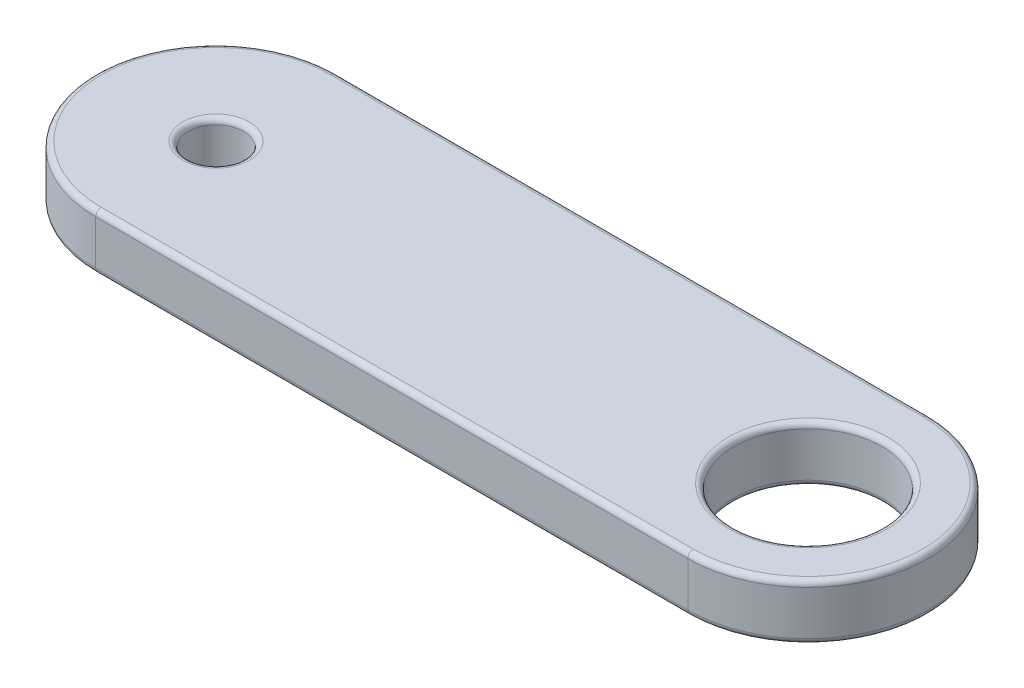
ISO-10303-21;
HEADER;
FILE_DESCRIPTION(('STEP AP214'),'2;1');
FILE_NAME('part.step','',(''),(''),'','','');
FILE_SCHEMA(('AUTOMOTIVE_DESIGN { 1 0 10303 214 1 1 1 1 }'));
ENDSEC;
DATA;
#1=APPLICATION_CONTEXT('core data for automotive mechanical design processes');
#2=APPLICATION_PROTOCOL_DEFINITION('international standard','automotive_design',2000,#1);
#3=PRODUCT_CONTEXT('',#1,'mechanical');
#4=PRODUCT('Part','Part','',(#3));
#5=PRODUCT_RELATED_PRODUCT_CATEGORY('part','',(#4));
#6=PRODUCT_DEFINITION_FORMATION('','',#4);
#7=PRODUCT_DEFINITION_CONTEXT('part definition',#1,'design');
#8=PRODUCT_DEFINITION('design','',#6,#7);
#9=PRODUCT_DEFINITION_SHAPE('','',#8);
#10=(LENGTH_UNIT() NAMED_UNIT(*) SI_UNIT(.MILLI.,.METRE.));
#11=(NAMED_UNIT(*) PLANE_ANGLE_UNIT() SI_UNIT($,.RADIAN.));
#12=(NAMED_UNIT(*) SI_UNIT($,.STERADIAN.) SOLID_ANGLE_UNIT());
#13=UNCERTAINTY_MEASURE_WITH_UNIT(LENGTH_MEASURE(1.E-05),#10,'distance_accuracy_value','');
#14=(GEOMETRIC_REPRESENTATION_CONTEXT(3) GLOBAL_UNCERTAINTY_ASSIGNED_CONTEXT((#13)) GLOBAL_UNIT_ASSIGNED_CONTEXT((#10,
#11,#12)) REPRESENTATION_CONTEXT('',''));
#15=CARTESIAN_POINT('',(0.,0.,0.));
#16=DIRECTION('',(0.,0.,1.));
#17=DIRECTION('',(1.,0.,0.));
#18=AXIS2_PLACEMENT_3D('',#15,#16,#17);
#19=CARTESIAN_POINT('',(-8.,0.75,0.));
#20=DIRECTION('',(0.,1.,0.));
#21=DIRECTION('',(0.,0.,1.));
#22=AXIS2_PLACEMENT_3D('',#19,#20,#21);
#23=PLANE('',#22);
#24=CARTESIAN_POINT('',(8.,0.75,0.));
#25=DIRECTION('',(0.,1.,0.));
#26=DIRECTION('',(0.,0.,1.));
#27=AXIS2_PLACEMENT_3D('',#24,#25,#26);
#28=CIRCLE('',#27,2.15);
#29=CARTESIAN_POINT('',(8.,0.75,2.15));
#30=VERTEX_POINT('',#29);
#31=EDGE_CURVE('E11',#30,#30,#28,.F.);
#32=ORIENTED_EDGE('',*,*,#31,.T.);
#33=EDGE_LOOP('',(#32));
#34=FACE_BOUND('',#33,.T.);
#35=CARTESIAN_POINT('',(8.,0.75,0.));
#36=DIRECTION('',(0.,1.,0.));
#37=DIRECTION('',(0.,0.,1.));
#38=AXIS2_PLACEMENT_3D('',#35,#36,#37);
#39=CIRCLE('',#38,3.1);
#40=CARTESIAN_POINT('',(8.,0.75,3.1));
#41=VERTEX_POINT('',#40);
#42=CARTESIAN_POINT('',(8.,0.75,-3.1));
#43=VERTEX_POINT('',#42);
#44=EDGE_CURVE('E57',#41,#43,#39,.T.);
#45=ORIENTED_EDGE('',*,*,#44,.T.);
#46=DIRECTION('',(-1.,0.,0.));
#47=VECTOR('',#46,1.);
#48=CARTESIAN_POINT('',(-8.,0.75,-3.1));
#49=LINE('',#48,#47);
#50=CARTESIAN_POINT('',(-8.,0.75,-3.1));
#51=VERTEX_POINT('',#50);
#52=EDGE_CURVE('E49',#43,#51,#49,.T.);
#53=ORIENTED_EDGE('',*,*,#52,.T.);
#54=CARTESIAN_POINT('',(-8.,0.75,0.));
#55=DIRECTION('',(0.,1.,0.));
#56=DIRECTION('',(0.,0.,1.));
#57=AXIS2_PLACEMENT_3D('',#54,#55,#56);
#58=CIRCLE('',#57,3.1);
#59=CARTESIAN_POINT('',(-8.,0.75,3.1));
#60=VERTEX_POINT('',#59);
#61=EDGE_CURVE('E175',#51,#60,#58,.T.);
#62=ORIENTED_EDGE('',*,*,#61,.T.);
#63=DIRECTION('',(1.,0.,0.));
#64=VECTOR('',#63,1.);
#65=CARTESIAN_POINT('',(8.,0.75,3.1));
#66=LINE('',#65,#64);
#67=EDGE_CURVE('E62',#60,#41,#66,.T.);
#68=ORIENTED_EDGE('',*,*,#67,.T.);
#69=EDGE_LOOP('',(#45,#53,#62,#68));
#70=FACE_BOUND('',#69,.T.);
#71=CARTESIAN_POINT('',(-8.,0.75,0.));
#72=DIRECTION('',(0.,1.,0.));
#73=DIRECTION('',(0.,0.,1.));
#74=AXIS2_PLACEMENT_3D('',#71,#72,#73);
#75=CIRCLE('',#74,0.899999999999998);
#76=CARTESIAN_POINT('',(-8.,0.75,0.899999999999999));
#77=VERTEX_POINT('',#76);
#78=EDGE_CURVE('E172',#77,#77,#75,.F.);
#79=ORIENTED_EDGE('',*,*,#78,.T.);
#80=EDGE_LOOP('',(#79));
#81=FACE_BOUND('',#80,.T.);
#82=ADVANCED_FACE('F40',(#34,#70,#81),#23,.T.);
#83=CARTESIAN_POINT('',(-8.,-0.75,0.));
#84=DIRECTION('',(0.,1.,0.));
#85=DIRECTION('',(0.,0.,1.));
#86=AXIS2_PLACEMENT_3D('',#83,#84,#85);
#87=PLANE('',#86);
#88=CARTESIAN_POINT('',(8.,-0.75,0.));
#89=DIRECTION('',(0.,1.,0.));
#90=DIRECTION('',(0.,0.,1.));
#91=AXIS2_PLACEMENT_3D('',#88,#89,#90);
#92=CIRCLE('',#91,2.15);
#93=CARTESIAN_POINT('',(8.,-0.75,2.15));
#94=VERTEX_POINT('',#93);
#95=EDGE_CURVE('E137',#94,#94,#92,.T.);
#96=ORIENTED_EDGE('',*,*,#95,.T.);
#97=EDGE_LOOP('',(#96));
#98=FACE_BOUND('',#97,.T.);
#99=CARTESIAN_POINT('',(-8.,-0.75,0.));
#100=DIRECTION('',(0.,1.,0.));
#101=DIRECTION('',(0.,0.,1.));
#102=AXIS2_PLACEMENT_3D('',#99,#100,#101);
#103=CIRCLE('',#102,0.899999999999998);
#104=CARTESIAN_POINT('',(-8.,-0.75,0.899999999999999));
#105=VERTEX_POINT('',#104);
#106=EDGE_CURVE('E134',#105,#105,#103,.T.);
#107=ORIENTED_EDGE('',*,*,#106,.T.);
#108=EDGE_LOOP('',(#107));
#109=FACE_BOUND('',#108,.T.);
#110=CARTESIAN_POINT('',(8.,-0.75,0.));
#111=DIRECTION('',(0.,1.,0.));
#112=DIRECTION('',(0.,0.,1.));
#113=AXIS2_PLACEMENT_3D('',#110,#111,#112);
#114=CIRCLE('',#113,3.1);
#115=CARTESIAN_POINT('',(8.,-0.75,-3.1));
#116=VERTEX_POINT('',#115);
#117=CARTESIAN_POINT('',(8.,-0.75,3.1));
#118=VERTEX_POINT('',#117);
#119=EDGE_CURVE('E133',#116,#118,#114,.F.);
#120=ORIENTED_EDGE('',*,*,#119,.T.);
#121=DIRECTION('',(1.,0.,0.));
#122=VECTOR('',#121,1.);
#123=CARTESIAN_POINT('',(-8.,-0.75,3.1));
#124=LINE('',#123,#122);
#125=CARTESIAN_POINT('',(-8.,-0.75,3.1));
#126=VERTEX_POINT('',#125);
#127=EDGE_CURVE('E112',#118,#126,#124,.F.);
#128=ORIENTED_EDGE('',*,*,#127,.T.);
#129=CARTESIAN_POINT('',(-8.,-0.75,0.));
#130=DIRECTION('',(0.,1.,0.));
#131=DIRECTION('',(0.,0.,1.));
#132=AXIS2_PLACEMENT_3D('',#129,#130,#131);
#133=CIRCLE('',#132,3.1);
#134=CARTESIAN_POINT('',(-8.,-0.75,-3.1));
#135=VERTEX_POINT('',#134);
#136=EDGE_CURVE('E122',#126,#135,#133,.F.);
#137=ORIENTED_EDGE('',*,*,#136,.T.);
#138=DIRECTION('',(-1.,0.,0.));
#139=VECTOR('',#138,1.);
#140=CARTESIAN_POINT('',(-8.,-0.75,-3.1));
#141=LINE('',#140,#139);
#142=EDGE_CURVE('E128',#135,#116,#141,.F.);
#143=ORIENTED_EDGE('',*,*,#142,.T.);
#144=EDGE_LOOP('',(#120,#128,#137,#143));
#145=FACE_BOUND('',#144,.T.);
#146=ADVANCED_FACE('F131',(#98,#109,#145),#87,.F.);
#147=CARTESIAN_POINT('',(-8.,0.75,0.));
#148=DIRECTION('',(0.,-1.,0.));
#149=DIRECTION('',(0.,0.,-1.));
#150=AXIS2_PLACEMENT_3D('',#147,#148,#149);
#151=CYLINDRICAL_SURFACE('',#150,3.25);
#152=DIRECTION('',(0.,-1.,0.));
#153=VECTOR('',#152,1.);
#154=CARTESIAN_POINT('',(-8.,0.75,-3.25));
#155=LINE('',#154,#153);
#156=CARTESIAN_POINT('',(-8.,0.6,-3.25));
#157=VERTEX_POINT('',#156);
#158=CARTESIAN_POINT('',(-8.,-0.6,-3.25));
#159=VERTEX_POINT('',#158);
#160=EDGE_CURVE('E184',#157,#159,#155,.T.);
#161=ORIENTED_EDGE('',*,*,#160,.T.);
#162=CARTESIAN_POINT('',(-8.,-0.6,0.));
#163=DIRECTION('',(0.,1.,0.));
#164=DIRECTION('',(0.,0.,1.));
#165=AXIS2_PLACEMENT_3D('',#162,#163,#164);
#166=CIRCLE('',#165,3.25);
#167=CARTESIAN_POINT('',(-8.,-0.6,3.25));
#168=VERTEX_POINT('',#167);
#169=EDGE_CURVE('E170',#159,#168,#166,.T.);
#170=ORIENTED_EDGE('',*,*,#169,.T.);
#171=DIRECTION('',(0.,-1.,0.));
#172=VECTOR('',#171,1.);
#173=CARTESIAN_POINT('',(-8.,0.75,3.25));
#174=LINE('',#173,#172);
#175=CARTESIAN_POINT('',(-8.,0.6,3.25));
#176=VERTEX_POINT('',#175);
#177=EDGE_CURVE('E129',#176,#168,#174,.T.);
#178=ORIENTED_EDGE('',*,*,#177,.F.);
#179=CARTESIAN_POINT('',(-8.,0.6,0.));
#180=DIRECTION('',(0.,1.,0.));
#181=DIRECTION('',(0.,0.,1.));
#182=AXIS2_PLACEMENT_3D('',#179,#180,#181);
#183=CIRCLE('',#182,3.25);
#184=EDGE_CURVE('E168',#176,#157,#183,.F.);
#185=ORIENTED_EDGE('',*,*,#184,.T.);
#186=EDGE_LOOP('',(#161,#170,#178,#185));
#187=FACE_BOUND('',#186,.T.);
#188=ADVANCED_FACE('F210',(#187),#151,.T.);
#189=CARTESIAN_POINT('',(-8.,0.75,3.25));
#190=DIRECTION('',(0.,0.,-1.));
#191=DIRECTION('',(-1.,0.,0.));
#192=AXIS2_PLACEMENT_3D('',#189,#190,#191);
#193=PLANE('',#192);
#194=ORIENTED_EDGE('',*,*,#177,.T.);
#195=DIRECTION('',(1.,0.,0.));
#196=VECTOR('',#195,1.);
#197=CARTESIAN_POINT('',(-8.,-0.6,3.25));
#198=LINE('',#197,#196);
#199=CARTESIAN_POINT('',(8.,-0.6,3.25));
#200=VERTEX_POINT('',#199);
#201=EDGE_CURVE('E115',#168,#200,#198,.T.);
#202=ORIENTED_EDGE('',*,*,#201,.T.);
#203=DIRECTION('',(0.,-1.,0.));
#204=VECTOR('',#203,1.);
#205=CARTESIAN_POINT('',(8.,0.75,3.25));
#206=LINE('',#205,#204);
#207=CARTESIAN_POINT('',(8.,0.6,3.25));
#208=VERTEX_POINT('',#207);
#209=EDGE_CURVE('E207',#208,#200,#206,.T.);
#210=ORIENTED_EDGE('',*,*,#209,.F.);
#211=DIRECTION('',(1.,0.,0.));
#212=VECTOR('',#211,1.);
#213=CARTESIAN_POINT('',(-8.,0.6,3.25));
#214=LINE('',#213,#212);
#215=EDGE_CURVE('E156',#208,#176,#214,.F.);
#216=ORIENTED_EDGE('',*,*,#215,.T.);
#217=EDGE_LOOP('',(#194,#202,#210,#216));
#218=FACE_BOUND('',#217,.T.);
#219=ADVANCED_FACE('F205',(#218),#193,.F.);
#220=CARTESIAN_POINT('',(8.,0.75,0.));
#221=DIRECTION('',(0.,-1.,0.));
#222=DIRECTION('',(0.,0.,-1.));
#223=AXIS2_PLACEMENT_3D('',#220,#221,#222);
#224=CYLINDRICAL_SURFACE('',#223,3.25);
#225=ORIENTED_EDGE('',*,*,#209,.T.);
#226=CARTESIAN_POINT('',(8.,-0.6,0.));
#227=DIRECTION('',(0.,1.,0.));
#228=DIRECTION('',(0.,0.,1.));
#229=AXIS2_PLACEMENT_3D('',#226,#227,#228);
#230=CIRCLE('',#229,3.25);
#231=CARTESIAN_POINT('',(8.,-0.6,-3.25));
#232=VERTEX_POINT('',#231);
#233=EDGE_CURVE('E161',#200,#232,#230,.T.);
#234=ORIENTED_EDGE('',*,*,#233,.T.);
#235=DIRECTION('',(0.,-1.,0.));
#236=VECTOR('',#235,1.);
#237=CARTESIAN_POINT('',(8.,0.75,-3.25));
#238=LINE('',#237,#236);
#239=CARTESIAN_POINT('',(8.,0.6,-3.25));
#240=VERTEX_POINT('',#239);
#241=EDGE_CURVE('E213',#240,#232,#238,.T.);
#242=ORIENTED_EDGE('',*,*,#241,.F.);
#243=CARTESIAN_POINT('',(8.,0.6,0.));
#244=DIRECTION('',(0.,1.,0.));
#245=DIRECTION('',(0.,0.,1.));
#246=AXIS2_PLACEMENT_3D('',#243,#244,#245);
#247=CIRCLE('',#246,3.25);
#248=EDGE_CURVE('E159',#240,#208,#247,.F.);
#249=ORIENTED_EDGE('',*,*,#248,.T.);
#250=EDGE_LOOP('',(#225,#234,#242,#249));
#251=FACE_BOUND('',#250,.T.);
#252=ADVANCED_FACE('F226',(#251),#224,.T.);
#253=CARTESIAN_POINT('',(-8.,0.75,-3.25));
#254=DIRECTION('',(0.,0.,1.));
#255=DIRECTION('',(1.,0.,0.));
#256=AXIS2_PLACEMENT_3D('',#253,#254,#255);
#257=PLANE('',#256);
#258=ORIENTED_EDGE('',*,*,#241,.T.);
#259=DIRECTION('',(-1.,0.,0.));
#260=VECTOR('',#259,1.);
#261=CARTESIAN_POINT('',(-8.,-0.6,-3.25));
#262=LINE('',#261,#260);
#263=EDGE_CURVE('E166',#232,#159,#262,.T.);
#264=ORIENTED_EDGE('',*,*,#263,.T.);
#265=ORIENTED_EDGE('',*,*,#160,.F.);
#266=DIRECTION('',(-1.,0.,0.));
#267=VECTOR('',#266,1.);
#268=CARTESIAN_POINT('',(8.,0.6,-3.25));
#269=LINE('',#268,#267);
#270=EDGE_CURVE('E163',#157,#240,#269,.F.);
#271=ORIENTED_EDGE('',*,*,#270,.T.);
#272=EDGE_LOOP('',(#258,#264,#265,#271));
#273=FACE_BOUND('',#272,.T.);
#274=ADVANCED_FACE('F230',(#273),#257,.F.);
#275=CARTESIAN_POINT('',(-8.,0.75,0.));
#276=DIRECTION('',(0.,-1.,0.));
#277=DIRECTION('',(0.,0.,-1.));
#278=AXIS2_PLACEMENT_3D('',#275,#276,#277);
#279=CYLINDRICAL_SURFACE('',#278,0.749999999999998);
#280=CARTESIAN_POINT('',(-8.,-0.6,0.));
#281=DIRECTION('',(0.,1.,0.));
#282=DIRECTION('',(0.,0.,1.));
#283=AXIS2_PLACEMENT_3D('',#280,#281,#282);
#284=CIRCLE('',#283,0.749999999999998);
#285=CARTESIAN_POINT('',(-8.,-0.6,0.749999999999999));
#286=VERTEX_POINT('',#285);
#287=EDGE_CURVE('E153',#286,#286,#284,.F.);
#288=ORIENTED_EDGE('',*,*,#287,.T.);
#289=EDGE_LOOP('',(#288));
#290=FACE_BOUND('',#289,.T.);
#291=CARTESIAN_POINT('',(-8.,0.6,0.));
#292=DIRECTION('',(0.,1.,0.));
#293=DIRECTION('',(0.,0.,1.));
#294=AXIS2_PLACEMENT_3D('',#291,#292,#293);
#295=CIRCLE('',#294,0.749999999999998);
#296=CARTESIAN_POINT('',(-8.,0.6,0.749999999999999));
#297=VERTEX_POINT('',#296);
#298=EDGE_CURVE('E150',#297,#297,#295,.T.);
#299=ORIENTED_EDGE('',*,*,#298,.T.);
#300=EDGE_LOOP('',(#299));
#301=FACE_BOUND('',#300,.T.);
#302=ADVANCED_FACE('F246',(#290,#301),#279,.F.);
#303=CARTESIAN_POINT('',(8.,0.75,0.));
#304=DIRECTION('',(0.,-1.,0.));
#305=DIRECTION('',(0.,0.,-1.));
#306=AXIS2_PLACEMENT_3D('',#303,#304,#305);
#307=CYLINDRICAL_SURFACE('',#306,2.);
#308=CARTESIAN_POINT('',(8.,-0.6,0.));
#309=DIRECTION('',(0.,1.,0.));
#310=DIRECTION('',(0.,0.,1.));
#311=AXIS2_PLACEMENT_3D('',#308,#309,#310);
#312=CIRCLE('',#311,2.);
#313=CARTESIAN_POINT('',(8.,-0.6,2.));
#314=VERTEX_POINT('',#313);
#315=EDGE_CURVE('E147',#314,#314,#312,.F.);
#316=ORIENTED_EDGE('',*,*,#315,.T.);
#317=EDGE_LOOP('',(#316));
#318=FACE_BOUND('',#317,.T.);
#319=CARTESIAN_POINT('',(8.,0.6,0.));
#320=DIRECTION('',(0.,1.,0.));
#321=DIRECTION('',(0.,0.,1.));
#322=AXIS2_PLACEMENT_3D('',#319,#320,#321);
#323=CIRCLE('',#322,2.);
#324=CARTESIAN_POINT('',(8.,0.6,2.));
#325=VERTEX_POINT('',#324);
#326=EDGE_CURVE('E144',#325,#325,#323,.T.);
#327=ORIENTED_EDGE('',*,*,#326,.T.);
#328=EDGE_LOOP('',(#327));
#329=FACE_BOUND('',#328,.T.);
#330=ADVANCED_FACE('F248',(#318,#329),#307,.F.);
#331=CARTESIAN_POINT('',(8.,-0.6,0.));
#332=DIRECTION('',(0.,1.,0.));
#333=DIRECTION('',(0.,0.,1.));
#334=AXIS2_PLACEMENT_3D('',#331,#332,#333);
#335=TOROIDAL_SURFACE('',#334,2.15,0.15);
#336=ORIENTED_EDGE('',*,*,#315,.F.);
#337=EDGE_LOOP('',(#336));
#338=FACE_BOUND('',#337,.T.);
#339=ORIENTED_EDGE('',*,*,#95,.F.);
#340=EDGE_LOOP('',(#339));
#341=FACE_BOUND('',#340,.T.);
#342=ADVANCED_FACE('F255',(#338,#341),#335,.T.);
#343=CARTESIAN_POINT('',(-8.,-0.6,0.));
#344=DIRECTION('',(0.,1.,0.));
#345=DIRECTION('',(0.,0.,1.));
#346=AXIS2_PLACEMENT_3D('',#343,#344,#345);
#347=TOROIDAL_SURFACE('',#346,0.899999999999998,0.15);
#348=ORIENTED_EDGE('',*,*,#287,.F.);
#349=EDGE_LOOP('',(#348));
#350=FACE_BOUND('',#349,.T.);
#351=ORIENTED_EDGE('',*,*,#106,.F.);
#352=EDGE_LOOP('',(#351));
#353=FACE_BOUND('',#352,.T.);
#354=ADVANCED_FACE('F271',(#350,#353),#347,.T.);
#355=CARTESIAN_POINT('',(-8.,-0.6,-3.1));
#356=DIRECTION('',(-1.,0.,0.));
#357=DIRECTION('',(0.,0.,1.));
#358=AXIS2_PLACEMENT_3D('',#355,#356,#357);
#359=CYLINDRICAL_SURFACE('',#358,0.15);
#360=CARTESIAN_POINT('',(8.,-0.6,-3.1));
#361=DIRECTION('',(1.,0.,0.));
#362=DIRECTION('',(0.,0.,-1.));
#363=AXIS2_PLACEMENT_3D('',#360,#361,#362);
#364=CIRCLE('',#363,0.15);
#365=EDGE_CURVE('E118',#116,#232,#364,.T.);
#366=ORIENTED_EDGE('',*,*,#365,.F.);
#367=ORIENTED_EDGE('',*,*,#142,.F.);
#368=CARTESIAN_POINT('',(-8.,-0.6,-3.1));
#369=DIRECTION('',(-1.,0.,0.));
#370=DIRECTION('',(0.,0.,1.));
#371=AXIS2_PLACEMENT_3D('',#368,#369,#370);
#372=CIRCLE('',#371,0.15);
#373=EDGE_CURVE('E125',#159,#135,#372,.T.);
#374=ORIENTED_EDGE('',*,*,#373,.F.);
#375=ORIENTED_EDGE('',*,*,#263,.F.);
#376=EDGE_LOOP('',(#366,#367,#374,#375));
#377=FACE_BOUND('',#376,.T.);
#378=ADVANCED_FACE('F219',(#377),#359,.T.);
#379=CARTESIAN_POINT('',(-8.,-0.6,0.));
#380=DIRECTION('',(0.,1.,0.));
#381=DIRECTION('',(0.,0.,1.));
#382=AXIS2_PLACEMENT_3D('',#379,#380,#381);
#383=TOROIDAL_SURFACE('',#382,3.1,0.15);
#384=ORIENTED_EDGE('',*,*,#373,.T.);
#385=ORIENTED_EDGE('',*,*,#136,.F.);
#386=CARTESIAN_POINT('',(-8.,-0.6,3.1));
#387=DIRECTION('',(1.,0.,0.));
#388=DIRECTION('',(0.,0.,-1.));
#389=AXIS2_PLACEMENT_3D('',#386,#387,#388);
#390=CIRCLE('',#389,0.15);
#391=EDGE_CURVE('E108',#168,#126,#390,.T.);
#392=ORIENTED_EDGE('',*,*,#391,.F.);
#393=ORIENTED_EDGE('',*,*,#169,.F.);
#394=EDGE_LOOP('',(#384,#385,#392,#393));
#395=FACE_BOUND('',#394,.T.);
#396=ADVANCED_FACE('F123',(#395),#383,.T.);
#397=CARTESIAN_POINT('',(8.,-0.6,0.));
#398=DIRECTION('',(0.,1.,0.));
#399=DIRECTION('',(0.,0.,1.));
#400=AXIS2_PLACEMENT_3D('',#397,#398,#399);
#401=TOROIDAL_SURFACE('',#400,3.1,0.15);
#402=ORIENTED_EDGE('',*,*,#365,.T.);
#403=ORIENTED_EDGE('',*,*,#233,.F.);
#404=CARTESIAN_POINT('',(8.,-0.6,3.1));
#405=DIRECTION('',(-1.,0.,0.));
#406=DIRECTION('',(0.,0.,1.));
#407=AXIS2_PLACEMENT_3D('',#404,#405,#406);
#408=CIRCLE('',#407,0.15);
#409=EDGE_CURVE('E119',#118,#200,#408,.T.);
#410=ORIENTED_EDGE('',*,*,#409,.F.);
#411=ORIENTED_EDGE('',*,*,#119,.F.);
#412=EDGE_LOOP('',(#402,#403,#410,#411));
#413=FACE_BOUND('',#412,.T.);
#414=ADVANCED_FACE('F222',(#413),#401,.T.);
#415=CARTESIAN_POINT('',(-8.,-0.6,3.1));
#416=DIRECTION('',(1.,0.,0.));
#417=DIRECTION('',(0.,0.,-1.));
#418=AXIS2_PLACEMENT_3D('',#415,#416,#417);
#419=CYLINDRICAL_SURFACE('',#418,0.15);
#420=ORIENTED_EDGE('',*,*,#391,.T.);
#421=ORIENTED_EDGE('',*,*,#127,.F.);
#422=ORIENTED_EDGE('',*,*,#409,.T.);
#423=ORIENTED_EDGE('',*,*,#201,.F.);
#424=EDGE_LOOP('',(#420,#421,#422,#423));
#425=FACE_BOUND('',#424,.T.);
#426=ADVANCED_FACE('F110',(#425),#419,.T.);
#427=CARTESIAN_POINT('',(8.,0.6,0.));
#428=DIRECTION('',(0.,1.,0.));
#429=DIRECTION('',(0.,0.,1.));
#430=AXIS2_PLACEMENT_3D('',#427,#428,#429);
#431=TOROIDAL_SURFACE('',#430,2.15,0.15);
#432=ORIENTED_EDGE('',*,*,#31,.F.);
#433=EDGE_LOOP('',(#432));
#434=FACE_BOUND('',#433,.T.);
#435=ORIENTED_EDGE('',*,*,#326,.F.);
#436=EDGE_LOOP('',(#435));
#437=FACE_BOUND('',#436,.T.);
#438=ADVANCED_FACE('F278',(#434,#437),#431,.T.);
#439=CARTESIAN_POINT('',(-8.,0.6,3.1));
#440=DIRECTION('',(-1.,0.,0.));
#441=DIRECTION('',(0.,0.,1.));
#442=AXIS2_PLACEMENT_3D('',#439,#440,#441);
#443=CYLINDRICAL_SURFACE('',#442,0.15);
#444=CARTESIAN_POINT('',(-8.,0.6,3.1));
#445=DIRECTION('',(-1.,0.,0.));
#446=DIRECTION('',(0.,0.,1.));
#447=AXIS2_PLACEMENT_3D('',#444,#445,#446);
#448=CIRCLE('',#447,0.15);
#449=EDGE_CURVE('E188',#176,#60,#448,.T.);
#450=ORIENTED_EDGE('',*,*,#449,.F.);
#451=ORIENTED_EDGE('',*,*,#215,.F.);
#452=CARTESIAN_POINT('',(8.,0.6,3.1));
#453=DIRECTION('',(1.,0.,0.));
#454=DIRECTION('',(0.,0.,-1.));
#455=AXIS2_PLACEMENT_3D('',#452,#453,#454);
#456=CIRCLE('',#455,0.15);
#457=EDGE_CURVE('E44',#41,#208,#456,.T.);
#458=ORIENTED_EDGE('',*,*,#457,.F.);
#459=ORIENTED_EDGE('',*,*,#67,.F.);
#460=EDGE_LOOP('',(#450,#451,#458,#459));
#461=FACE_BOUND('',#460,.T.);
#462=ADVANCED_FACE('F200',(#461),#443,.T.);
#463=CARTESIAN_POINT('',(8.,0.6,0.));
#464=DIRECTION('',(0.,1.,0.));
#465=DIRECTION('',(0.,0.,1.));
#466=AXIS2_PLACEMENT_3D('',#463,#464,#465);
#467=TOROIDAL_SURFACE('',#466,3.1,0.15);
#468=ORIENTED_EDGE('',*,*,#457,.T.);
#469=ORIENTED_EDGE('',*,*,#248,.F.);
#470=CARTESIAN_POINT('',(8.,0.6,-3.1));
#471=DIRECTION('',(-1.,0.,0.));
#472=DIRECTION('',(0.,0.,1.));
#473=AXIS2_PLACEMENT_3D('',#470,#471,#472);
#474=CIRCLE('',#473,0.15);
#475=EDGE_CURVE('E187',#43,#240,#474,.T.);
#476=ORIENTED_EDGE('',*,*,#475,.F.);
#477=ORIENTED_EDGE('',*,*,#44,.F.);
#478=EDGE_LOOP('',(#468,#469,#476,#477));
#479=FACE_BOUND('',#478,.T.);
#480=ADVANCED_FACE('F197',(#479),#467,.T.);
#481=CARTESIAN_POINT('',(-8.,0.6,0.));
#482=DIRECTION('',(0.,1.,0.));
#483=DIRECTION('',(0.,0.,1.));
#484=AXIS2_PLACEMENT_3D('',#481,#482,#483);
#485=TOROIDAL_SURFACE('',#484,3.1,0.15);
#486=ORIENTED_EDGE('',*,*,#449,.T.);
#487=ORIENTED_EDGE('',*,*,#61,.F.);
#488=CARTESIAN_POINT('',(-8.,0.6,-3.1));
#489=DIRECTION('',(1.,0.,0.));
#490=DIRECTION('',(0.,0.,-1.));
#491=AXIS2_PLACEMENT_3D('',#488,#489,#490);
#492=CIRCLE('',#491,0.15);
#493=EDGE_CURVE('E185',#157,#51,#492,.T.);
#494=ORIENTED_EDGE('',*,*,#493,.F.);
#495=ORIENTED_EDGE('',*,*,#184,.F.);
#496=EDGE_LOOP('',(#486,#487,#494,#495));
#497=FACE_BOUND('',#496,.T.);
#498=ADVANCED_FACE('F235',(#497),#485,.T.);
#499=CARTESIAN_POINT('',(-8.,0.6,-3.1));
#500=DIRECTION('',(1.,0.,0.));
#501=DIRECTION('',(0.,0.,-1.));
#502=AXIS2_PLACEMENT_3D('',#499,#500,#501);
#503=CYLINDRICAL_SURFACE('',#502,0.15);
#504=ORIENTED_EDGE('',*,*,#475,.T.);
#505=ORIENTED_EDGE('',*,*,#270,.F.);
#506=ORIENTED_EDGE('',*,*,#493,.T.);
#507=ORIENTED_EDGE('',*,*,#52,.F.);
#508=EDGE_LOOP('',(#504,#505,#506,#507));
#509=FACE_BOUND('',#508,.T.);
#510=ADVANCED_FACE('F233',(#509),#503,.T.);
#511=CARTESIAN_POINT('',(-8.,0.6,0.));
#512=DIRECTION('',(0.,1.,0.));
#513=DIRECTION('',(0.,0.,1.));
#514=AXIS2_PLACEMENT_3D('',#511,#512,#513);
#515=TOROIDAL_SURFACE('',#514,0.899999999999998,0.15);
#516=ORIENTED_EDGE('',*,*,#78,.F.);
#517=EDGE_LOOP('',(#516));
#518=FACE_BOUND('',#517,.T.);
#519=ORIENTED_EDGE('',*,*,#298,.F.);
#520=EDGE_LOOP('',(#519));
#521=FACE_BOUND('',#520,.T.);
#522=ADVANCED_FACE('F42',(#518,#521),#515,.T.);
#523=CLOSED_SHELL('',(#82,#146,#188,#219,#252,#274,#302,#330,#342,#354,#378,#396,#414,#426,#438,
#462,#480,#498,#510,#522));
#524=MANIFOLD_SOLID_BREP('B2',#523);
#525=ADVANCED_BREP_SHAPE_REPRESENTATION('',(#18,#524),#14);
#526=SHAPE_DEFINITION_REPRESENTATION(#9,#525);
ENDSEC;
END-ISO-10303-21;
